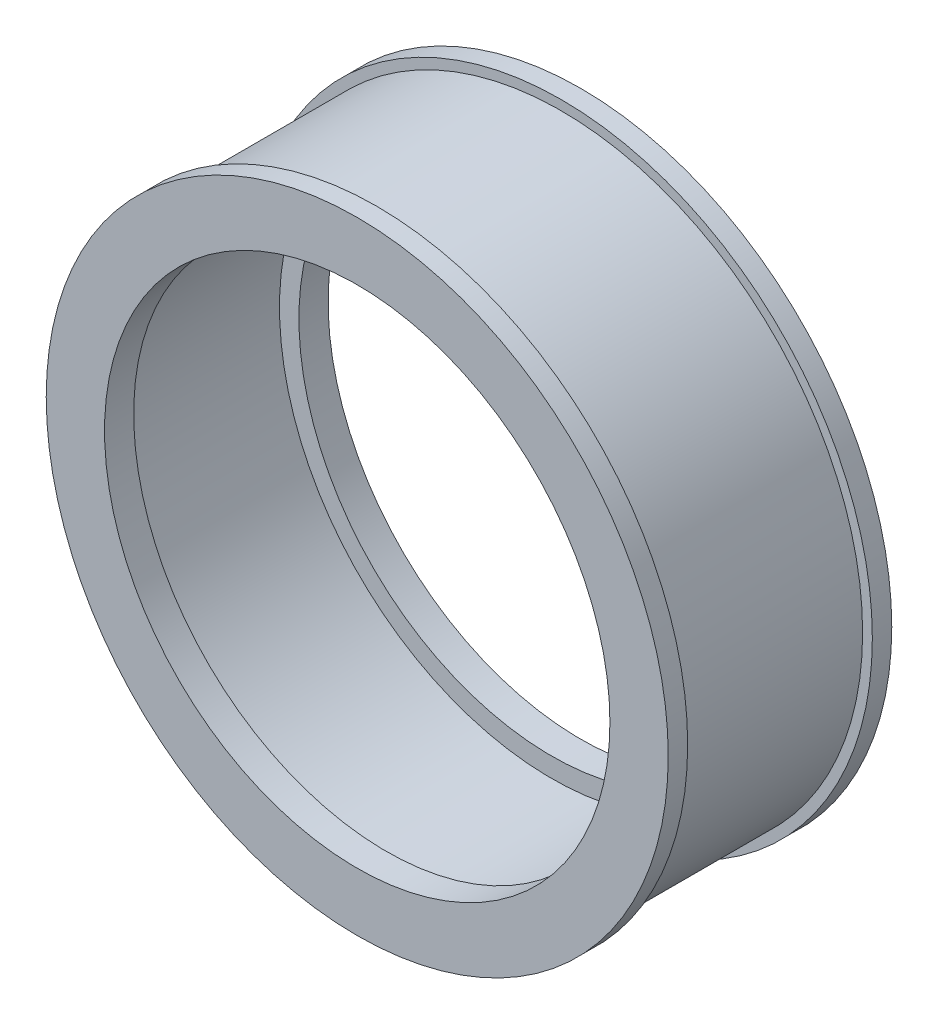
ISO-10303-21;
HEADER;
FILE_DESCRIPTION(('STEP AP214'),'2;1');
FILE_NAME('part.step','',(''),(''),'','','');
FILE_SCHEMA(('AUTOMOTIVE_DESIGN { 1 0 10303 214 1 1 1 1 }'));
ENDSEC;
DATA;
#1=APPLICATION_CONTEXT('core data for automotive mechanical design processes');
#2=APPLICATION_PROTOCOL_DEFINITION('international standard','automotive_design',2000,#1);
#3=PRODUCT_CONTEXT('',#1,'mechanical');
#4=PRODUCT('Part','Part','',(#3));
#5=PRODUCT_RELATED_PRODUCT_CATEGORY('part','',(#4));
#6=PRODUCT_DEFINITION_FORMATION('','',#4);
#7=PRODUCT_DEFINITION_CONTEXT('part definition',#1,'design');
#8=PRODUCT_DEFINITION('design','',#6,#7);
#9=PRODUCT_DEFINITION_SHAPE('','',#8);
#10=(LENGTH_UNIT() NAMED_UNIT(*) SI_UNIT(.MILLI.,.METRE.));
#11=(NAMED_UNIT(*) PLANE_ANGLE_UNIT() SI_UNIT($,.RADIAN.));
#12=(NAMED_UNIT(*) SI_UNIT($,.STERADIAN.) SOLID_ANGLE_UNIT());
#13=UNCERTAINTY_MEASURE_WITH_UNIT(LENGTH_MEASURE(1.E-05),#10,'distance_accuracy_value','');
#14=(GEOMETRIC_REPRESENTATION_CONTEXT(3) GLOBAL_UNCERTAINTY_ASSIGNED_CONTEXT((#13)) GLOBAL_UNIT_ASSIGNED_CONTEXT((#10,
#11,#12)) REPRESENTATION_CONTEXT('',''));
#15=CARTESIAN_POINT('',(0.,0.,0.));
#16=DIRECTION('',(0.,0.,1.));
#17=DIRECTION('',(1.,0.,0.));
#18=AXIS2_PLACEMENT_3D('',#15,#16,#17);
#19=CARTESIAN_POINT('',(0.,0.,0.));
#20=DIRECTION('',(0.,0.,1.));
#21=DIRECTION('',(1.,0.,0.));
#22=AXIS2_PLACEMENT_3D('',#19,#20,#21);
#23=CYLINDRICAL_SURFACE('',#22,26.);
#24=CARTESIAN_POINT('',(0.,0.,-8.5));
#25=DIRECTION('',(0.,0.,1.));
#26=DIRECTION('',(1.,0.,0.));
#27=AXIS2_PLACEMENT_3D('',#24,#25,#26);
#28=CIRCLE('',#27,26.);
#29=CARTESIAN_POINT('',(26.,0.,-8.5));
#30=VERTEX_POINT('',#29);
#31=EDGE_CURVE('E69',#30,#30,#28,.T.);
#32=ORIENTED_EDGE('',*,*,#31,.T.);
#33=EDGE_LOOP('',(#32));
#34=FACE_BOUND('',#33,.T.);
#35=CARTESIAN_POINT('',(0.,0.,-11.5));
#36=DIRECTION('',(0.,0.,1.));
#37=DIRECTION('',(1.,0.,0.));
#38=AXIS2_PLACEMENT_3D('',#35,#36,#37);
#39=CIRCLE('',#38,26.);
#40=CARTESIAN_POINT('',(26.,0.,-11.5));
#41=VERTEX_POINT('',#40);
#42=EDGE_CURVE('E10',#41,#41,#39,.T.);
#43=ORIENTED_EDGE('',*,*,#42,.F.);
#44=EDGE_LOOP('',(#43));
#45=FACE_BOUND('',#44,.T.);
#46=ADVANCED_FACE('F29',(#34,#45),#23,.F.);
#47=CARTESIAN_POINT('',(26.,0.,-11.5));
#48=DIRECTION('',(0.,0.,-1.));
#49=DIRECTION('',(-1.,0.,0.));
#50=AXIS2_PLACEMENT_3D('',#47,#48,#49);
#51=PLANE('',#50);
#52=ORIENTED_EDGE('',*,*,#42,.T.);
#53=EDGE_LOOP('',(#52));
#54=FACE_BOUND('',#53,.T.);
#55=CARTESIAN_POINT('',(0.,0.,-11.5));
#56=DIRECTION('',(0.,0.,1.));
#57=DIRECTION('',(1.,0.,0.));
#58=AXIS2_PLACEMENT_3D('',#55,#56,#57);
#59=CIRCLE('',#58,32.);
#60=CARTESIAN_POINT('',(32.,0.,-11.5));
#61=VERTEX_POINT('',#60);
#62=EDGE_CURVE('E35',#61,#61,#59,.T.);
#63=ORIENTED_EDGE('',*,*,#62,.F.);
#64=EDGE_LOOP('',(#63));
#65=FACE_BOUND('',#64,.T.);
#66=ADVANCED_FACE('F87',(#54,#65),#51,.T.);
#67=CARTESIAN_POINT('',(0.,0.,0.));
#68=DIRECTION('',(0.,0.,1.));
#69=DIRECTION('',(1.,0.,0.));
#70=AXIS2_PLACEMENT_3D('',#67,#68,#69);
#71=CYLINDRICAL_SURFACE('',#70,32.);
#72=ORIENTED_EDGE('',*,*,#62,.T.);
#73=EDGE_LOOP('',(#72));
#74=FACE_BOUND('',#73,.T.);
#75=CARTESIAN_POINT('',(0.,0.,-9.5));
#76=DIRECTION('',(0.,0.,1.));
#77=DIRECTION('',(1.,0.,0.));
#78=AXIS2_PLACEMENT_3D('',#75,#76,#77);
#79=CIRCLE('',#78,32.);
#80=CARTESIAN_POINT('',(32.,0.,-9.5));
#81=VERTEX_POINT('',#80);
#82=EDGE_CURVE('E39',#81,#81,#79,.T.);
#83=ORIENTED_EDGE('',*,*,#82,.F.);
#84=EDGE_LOOP('',(#83));
#85=FACE_BOUND('',#84,.T.);
#86=ADVANCED_FACE('F91',(#74,#85),#71,.T.);
#87=CARTESIAN_POINT('',(31.,0.,-9.5));
#88=DIRECTION('',(0.,0.,1.));
#89=DIRECTION('',(1.,0.,0.));
#90=AXIS2_PLACEMENT_3D('',#87,#88,#89);
#91=PLANE('',#90);
#92=ORIENTED_EDGE('',*,*,#82,.T.);
#93=EDGE_LOOP('',(#92));
#94=FACE_BOUND('',#93,.T.);
#95=CARTESIAN_POINT('',(0.,0.,-9.5));
#96=DIRECTION('',(0.,0.,1.));
#97=DIRECTION('',(1.,0.,0.));
#98=AXIS2_PLACEMENT_3D('',#95,#96,#97);
#99=CIRCLE('',#98,31.);
#100=CARTESIAN_POINT('',(31.,0.,-9.5));
#101=VERTEX_POINT('',#100);
#102=EDGE_CURVE('E43',#101,#101,#99,.T.);
#103=ORIENTED_EDGE('',*,*,#102,.F.);
#104=EDGE_LOOP('',(#103));
#105=FACE_BOUND('',#104,.T.);
#106=ADVANCED_FACE('F95',(#94,#105),#91,.T.);
#107=CARTESIAN_POINT('',(0.,0.,0.));
#108=DIRECTION('',(0.,0.,1.));
#109=DIRECTION('',(1.,0.,0.));
#110=AXIS2_PLACEMENT_3D('',#107,#108,#109);
#111=CYLINDRICAL_SURFACE('',#110,31.);
#112=ORIENTED_EDGE('',*,*,#102,.T.);
#113=EDGE_LOOP('',(#112));
#114=FACE_BOUND('',#113,.T.);
#115=CARTESIAN_POINT('',(0.,0.,9.5));
#116=DIRECTION('',(0.,0.,1.));
#117=DIRECTION('',(1.,0.,0.));
#118=AXIS2_PLACEMENT_3D('',#115,#116,#117);
#119=CIRCLE('',#118,31.);
#120=CARTESIAN_POINT('',(31.,0.,9.5));
#121=VERTEX_POINT('',#120);
#122=EDGE_CURVE('E48',#121,#121,#119,.T.);
#123=ORIENTED_EDGE('',*,*,#122,.F.);
#124=EDGE_LOOP('',(#123));
#125=FACE_BOUND('',#124,.T.);
#126=ADVANCED_FACE('F101',(#114,#125),#111,.T.);
#127=CARTESIAN_POINT('',(31.,0.,9.5));
#128=DIRECTION('',(0.,0.,-1.));
#129=DIRECTION('',(-1.,0.,0.));
#130=AXIS2_PLACEMENT_3D('',#127,#128,#129);
#131=PLANE('',#130);
#132=ORIENTED_EDGE('',*,*,#122,.T.);
#133=EDGE_LOOP('',(#132));
#134=FACE_BOUND('',#133,.T.);
#135=CARTESIAN_POINT('',(0.,0.,9.5));
#136=DIRECTION('',(0.,0.,1.));
#137=DIRECTION('',(1.,0.,0.));
#138=AXIS2_PLACEMENT_3D('',#135,#136,#137);
#139=CIRCLE('',#138,32.);
#140=CARTESIAN_POINT('',(32.,0.,9.5));
#141=VERTEX_POINT('',#140);
#142=EDGE_CURVE('E51',#141,#141,#139,.T.);
#143=ORIENTED_EDGE('',*,*,#142,.F.);
#144=EDGE_LOOP('',(#143));
#145=FACE_BOUND('',#144,.T.);
#146=ADVANCED_FACE('F105',(#134,#145),#131,.T.);
#147=CARTESIAN_POINT('',(0.,0.,0.));
#148=DIRECTION('',(0.,0.,1.));
#149=DIRECTION('',(1.,0.,0.));
#150=AXIS2_PLACEMENT_3D('',#147,#148,#149);
#151=CYLINDRICAL_SURFACE('',#150,32.);
#152=ORIENTED_EDGE('',*,*,#142,.T.);
#153=EDGE_LOOP('',(#152));
#154=FACE_BOUND('',#153,.T.);
#155=CARTESIAN_POINT('',(0.,0.,11.5));
#156=DIRECTION('',(0.,0.,1.));
#157=DIRECTION('',(1.,0.,0.));
#158=AXIS2_PLACEMENT_3D('',#155,#156,#157);
#159=CIRCLE('',#158,32.);
#160=CARTESIAN_POINT('',(32.,0.,11.5));
#161=VERTEX_POINT('',#160);
#162=EDGE_CURVE('E54',#161,#161,#159,.T.);
#163=ORIENTED_EDGE('',*,*,#162,.F.);
#164=EDGE_LOOP('',(#163));
#165=FACE_BOUND('',#164,.T.);
#166=ADVANCED_FACE('F109',(#154,#165),#151,.T.);
#167=CARTESIAN_POINT('',(26.,0.,11.5));
#168=DIRECTION('',(0.,0.,1.));
#169=DIRECTION('',(1.,0.,0.));
#170=AXIS2_PLACEMENT_3D('',#167,#168,#169);
#171=PLANE('',#170);
#172=ORIENTED_EDGE('',*,*,#162,.T.);
#173=EDGE_LOOP('',(#172));
#174=FACE_BOUND('',#173,.T.);
#175=CARTESIAN_POINT('',(0.,0.,11.5));
#176=DIRECTION('',(0.,0.,1.));
#177=DIRECTION('',(1.,0.,0.));
#178=AXIS2_PLACEMENT_3D('',#175,#176,#177);
#179=CIRCLE('',#178,26.);
#180=CARTESIAN_POINT('',(26.,0.,11.5));
#181=VERTEX_POINT('',#180);
#182=EDGE_CURVE('E57',#181,#181,#179,.T.);
#183=ORIENTED_EDGE('',*,*,#182,.F.);
#184=EDGE_LOOP('',(#183));
#185=FACE_BOUND('',#184,.T.);
#186=ADVANCED_FACE('F113',(#174,#185),#171,.T.);
#187=CARTESIAN_POINT('',(0.,0.,0.));
#188=DIRECTION('',(0.,0.,1.));
#189=DIRECTION('',(1.,0.,0.));
#190=AXIS2_PLACEMENT_3D('',#187,#188,#189);
#191=CYLINDRICAL_SURFACE('',#190,26.);
#192=ORIENTED_EDGE('',*,*,#182,.T.);
#193=EDGE_LOOP('',(#192));
#194=FACE_BOUND('',#193,.T.);
#195=CARTESIAN_POINT('',(0.,0.,8.5));
#196=DIRECTION('',(0.,0.,1.));
#197=DIRECTION('',(1.,0.,0.));
#198=AXIS2_PLACEMENT_3D('',#195,#196,#197);
#199=CIRCLE('',#198,26.);
#200=CARTESIAN_POINT('',(26.,0.,8.5));
#201=VERTEX_POINT('',#200);
#202=EDGE_CURVE('E60',#201,#201,#199,.T.);
#203=ORIENTED_EDGE('',*,*,#202,.F.);
#204=EDGE_LOOP('',(#203));
#205=FACE_BOUND('',#204,.T.);
#206=ADVANCED_FACE('F117',(#194,#205),#191,.F.);
#207=CARTESIAN_POINT('',(28.,0.,8.5));
#208=DIRECTION('',(0.,0.,-1.));
#209=DIRECTION('',(-1.,0.,0.));
#210=AXIS2_PLACEMENT_3D('',#207,#208,#209);
#211=PLANE('',#210);
#212=ORIENTED_EDGE('',*,*,#202,.T.);
#213=EDGE_LOOP('',(#212));
#214=FACE_BOUND('',#213,.T.);
#215=CARTESIAN_POINT('',(0.,0.,8.5));
#216=DIRECTION('',(0.,0.,1.));
#217=DIRECTION('',(1.,0.,0.));
#218=AXIS2_PLACEMENT_3D('',#215,#216,#217);
#219=CIRCLE('',#218,28.);
#220=CARTESIAN_POINT('',(28.,0.,8.5));
#221=VERTEX_POINT('',#220);
#222=EDGE_CURVE('E63',#221,#221,#219,.T.);
#223=ORIENTED_EDGE('',*,*,#222,.F.);
#224=EDGE_LOOP('',(#223));
#225=FACE_BOUND('',#224,.T.);
#226=ADVANCED_FACE('F83',(#214,#225),#211,.T.);
#227=CARTESIAN_POINT('',(0.,0.,0.));
#228=DIRECTION('',(0.,0.,1.));
#229=DIRECTION('',(1.,0.,0.));
#230=AXIS2_PLACEMENT_3D('',#227,#228,#229);
#231=CYLINDRICAL_SURFACE('',#230,28.);
#232=ORIENTED_EDGE('',*,*,#222,.T.);
#233=EDGE_LOOP('',(#232));
#234=FACE_BOUND('',#233,.T.);
#235=CARTESIAN_POINT('',(0.,0.,-8.5));
#236=DIRECTION('',(0.,0.,1.));
#237=DIRECTION('',(1.,0.,0.));
#238=AXIS2_PLACEMENT_3D('',#235,#236,#237);
#239=CIRCLE('',#238,28.);
#240=CARTESIAN_POINT('',(28.,0.,-8.5));
#241=VERTEX_POINT('',#240);
#242=EDGE_CURVE('E66',#241,#241,#239,.T.);
#243=ORIENTED_EDGE('',*,*,#242,.F.);
#244=EDGE_LOOP('',(#243));
#245=FACE_BOUND('',#244,.T.);
#246=ADVANCED_FACE('F77',(#234,#245),#231,.F.);
#247=CARTESIAN_POINT('',(28.,0.,-8.5));
#248=DIRECTION('',(0.,0.,1.));
#249=DIRECTION('',(1.,0.,0.));
#250=AXIS2_PLACEMENT_3D('',#247,#248,#249);
#251=PLANE('',#250);
#252=ORIENTED_EDGE('',*,*,#242,.T.);
#253=EDGE_LOOP('',(#252));
#254=FACE_BOUND('',#253,.T.);
#255=ORIENTED_EDGE('',*,*,#31,.F.);
#256=EDGE_LOOP('',(#255));
#257=FACE_BOUND('',#256,.T.);
#258=ADVANCED_FACE('F75',(#254,#257),#251,.T.);
#259=CLOSED_SHELL('',(#46,#66,#86,#106,#126,#146,#166,#186,#206,#226,#246,#258));
#260=MANIFOLD_SOLID_BREP('B2',#259);
#261=ADVANCED_BREP_SHAPE_REPRESENTATION('',(#18,#260),#14);
#262=SHAPE_DEFINITION_REPRESENTATION(#9,#261);
ENDSEC;
END-ISO-10303-21;
